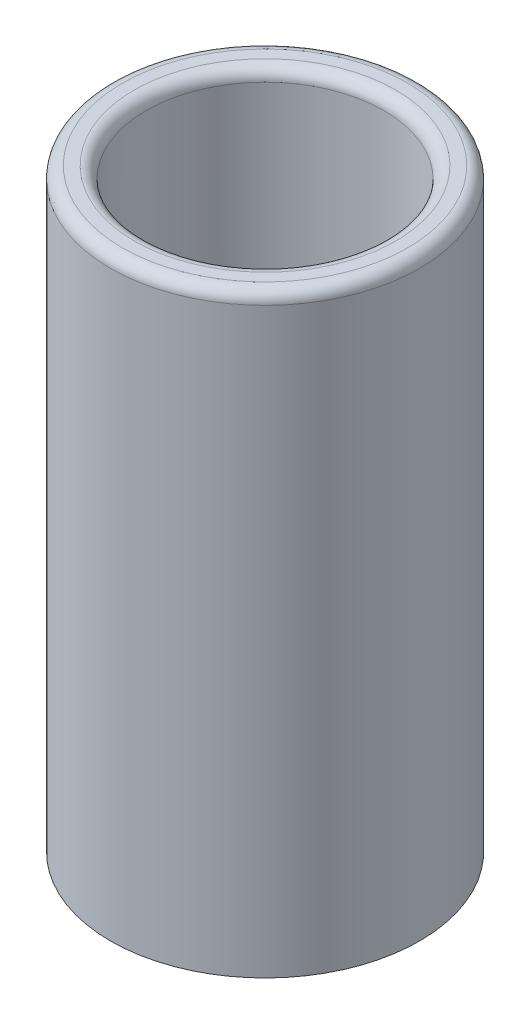
ISO-10303-21;
HEADER;
FILE_DESCRIPTION(('STEP AP214'),'2;1');
FILE_NAME('part.step','',(''),(''),'','','');
FILE_SCHEMA(('AUTOMOTIVE_DESIGN { 1 0 10303 214 1 1 1 1 }'));
ENDSEC;
DATA;
#1=APPLICATION_CONTEXT('core data for automotive mechanical design processes');
#2=APPLICATION_PROTOCOL_DEFINITION('international standard','automotive_design',2000,#1);
#3=PRODUCT_CONTEXT('',#1,'mechanical');
#4=PRODUCT('Part','Part','',(#3));
#5=PRODUCT_RELATED_PRODUCT_CATEGORY('part','',(#4));
#6=PRODUCT_DEFINITION_FORMATION('','',#4);
#7=PRODUCT_DEFINITION_CONTEXT('part definition',#1,'design');
#8=PRODUCT_DEFINITION('design','',#6,#7);
#9=PRODUCT_DEFINITION_SHAPE('','',#8);
#10=(LENGTH_UNIT() NAMED_UNIT(*) SI_UNIT(.MILLI.,.METRE.));
#11=(NAMED_UNIT(*) PLANE_ANGLE_UNIT() SI_UNIT($,.RADIAN.));
#12=(NAMED_UNIT(*) SI_UNIT($,.STERADIAN.) SOLID_ANGLE_UNIT());
#13=UNCERTAINTY_MEASURE_WITH_UNIT(LENGTH_MEASURE(1.E-05),#10,'distance_accuracy_value','');
#14=(GEOMETRIC_REPRESENTATION_CONTEXT(3) GLOBAL_UNCERTAINTY_ASSIGNED_CONTEXT((#13)) GLOBAL_UNIT_ASSIGNED_CONTEXT((#10,
#11,#12)) REPRESENTATION_CONTEXT('',''));
#15=CARTESIAN_POINT('',(0.,0.,0.));
#16=DIRECTION('',(0.,0.,1.));
#17=DIRECTION('',(1.,0.,0.));
#18=AXIS2_PLACEMENT_3D('',#15,#16,#17);
#19=CARTESIAN_POINT('',(0.,25.,0.));
#20=DIRECTION('',(0.,-1.,0.));
#21=DIRECTION('',(0.,0.,-1.));
#22=AXIS2_PLACEMENT_3D('',#19,#20,#21);
#23=CYLINDRICAL_SURFACE('',#22,6.5);
#24=CARTESIAN_POINT('',(0.,24.5,0.));
#25=DIRECTION('',(0.,1.,0.));
#26=DIRECTION('',(0.,0.,1.));
#27=AXIS2_PLACEMENT_3D('',#24,#25,#26);
#28=CIRCLE('',#27,6.5);
#29=CARTESIAN_POINT('',(0.,24.5,6.5));
#30=VERTEX_POINT('',#29);
#31=EDGE_CURVE('E11',#30,#30,#28,.F.);
#32=ORIENTED_EDGE('',*,*,#31,.T.);
#33=EDGE_LOOP('',(#32));
#34=FACE_BOUND('',#33,.T.);
#35=CARTESIAN_POINT('',(0.,0.,0.));
#36=DIRECTION('',(0.,1.,0.));
#37=DIRECTION('',(0.,0.,1.));
#38=AXIS2_PLACEMENT_3D('',#35,#36,#37);
#39=CIRCLE('',#38,6.5);
#40=CARTESIAN_POINT('',(0.,0.,6.5));
#41=VERTEX_POINT('',#40);
#42=EDGE_CURVE('E118',#41,#41,#39,.T.);
#43=ORIENTED_EDGE('',*,*,#42,.T.);
#44=EDGE_LOOP('',(#43));
#45=FACE_BOUND('',#44,.T.);
#46=ADVANCED_FACE('F45',(#34,#45),#23,.T.);
#47=CARTESIAN_POINT('',(0.,25.,0.));
#48=DIRECTION('',(0.,1.,0.));
#49=DIRECTION('',(0.,0.,1.));
#50=AXIS2_PLACEMENT_3D('',#47,#48,#49);
#51=PLANE('',#50);
#52=CARTESIAN_POINT('',(0.,25.,0.));
#53=DIRECTION('',(0.,1.,0.));
#54=DIRECTION('',(0.,0.,1.));
#55=AXIS2_PLACEMENT_3D('',#52,#53,#54);
#56=CIRCLE('',#55,6.);
#57=CARTESIAN_POINT('',(0.,25.,6.));
#58=VERTEX_POINT('',#57);
#59=EDGE_CURVE('E54',#58,#58,#56,.T.);
#60=ORIENTED_EDGE('',*,*,#59,.T.);
#61=EDGE_LOOP('',(#60));
#62=FACE_BOUND('',#61,.T.);
#63=CARTESIAN_POINT('',(0.,25.,0.));
#64=DIRECTION('',(0.,1.,0.));
#65=DIRECTION('',(0.,0.,1.));
#66=AXIS2_PLACEMENT_3D('',#63,#64,#65);
#67=CIRCLE('',#66,5.5);
#68=CARTESIAN_POINT('',(0.,25.,5.5));
#69=VERTEX_POINT('',#68);
#70=EDGE_CURVE('E128',#69,#69,#67,.F.);
#71=ORIENTED_EDGE('',*,*,#70,.T.);
#72=EDGE_LOOP('',(#71));
#73=FACE_BOUND('',#72,.T.);
#74=ADVANCED_FACE('F139',(#62,#73),#51,.T.);
#75=CARTESIAN_POINT('',(0.,0.,0.));
#76=DIRECTION('',(0.,1.,0.));
#77=DIRECTION('',(0.,0.,1.));
#78=AXIS2_PLACEMENT_3D('',#75,#76,#77);
#79=PLANE('',#78);
#80=DIRECTION('',(-1.,0.,0.));
#81=VECTOR('',#80,1.);
#82=CARTESIAN_POINT('',(-2.5,0.,1.5));
#83=LINE('',#82,#81);
#84=CARTESIAN_POINT('',(2.5,0.,1.5));
#85=VERTEX_POINT('',#84);
#86=CARTESIAN_POINT('',(-2.5,0.,1.5));
#87=VERTEX_POINT('',#86);
#88=EDGE_CURVE('E104',#85,#87,#83,.T.);
#89=ORIENTED_EDGE('',*,*,#88,.F.);
#90=DIRECTION('',(0.,0.,1.));
#91=VECTOR('',#90,1.);
#92=CARTESIAN_POINT('',(2.5,0.,1.5));
#93=LINE('',#92,#91);
#94=CARTESIAN_POINT('',(2.5,0.,-1.5));
#95=VERTEX_POINT('',#94);
#96=EDGE_CURVE('E61',#95,#85,#93,.T.);
#97=ORIENTED_EDGE('',*,*,#96,.F.);
#98=DIRECTION('',(1.,0.,0.));
#99=VECTOR('',#98,1.);
#100=CARTESIAN_POINT('',(-2.5,0.,-1.5));
#101=LINE('',#100,#99);
#102=CARTESIAN_POINT('',(-2.5,0.,-1.5));
#103=VERTEX_POINT('',#102);
#104=EDGE_CURVE('E89',#103,#95,#101,.T.);
#105=ORIENTED_EDGE('',*,*,#104,.F.);
#106=DIRECTION('',(0.,0.,-1.));
#107=VECTOR('',#106,1.);
#108=CARTESIAN_POINT('',(-2.5,0.,1.5));
#109=LINE('',#108,#107);
#110=EDGE_CURVE('E97',#87,#103,#109,.T.);
#111=ORIENTED_EDGE('',*,*,#110,.F.);
#112=EDGE_LOOP('',(#89,#97,#105,#111));
#113=FACE_BOUND('',#112,.T.);
#114=ORIENTED_EDGE('',*,*,#42,.F.);
#115=EDGE_LOOP('',(#114));
#116=FACE_BOUND('',#115,.T.);
#117=ADVANCED_FACE('F106',(#113,#116),#79,.F.);
#118=CARTESIAN_POINT('',(2.5,7.,1.5));
#119=DIRECTION('',(1.,0.,0.));
#120=DIRECTION('',(0.,0.,-1.));
#121=AXIS2_PLACEMENT_3D('',#118,#119,#120);
#122=PLANE('',#121);
#123=ORIENTED_EDGE('',*,*,#96,.T.);
#124=DIRECTION('',(0.,-1.,0.));
#125=VECTOR('',#124,1.);
#126=CARTESIAN_POINT('',(2.5,7.,1.5));
#127=LINE('',#126,#125);
#128=CARTESIAN_POINT('',(2.5,7.,1.5));
#129=VERTEX_POINT('',#128);
#130=EDGE_CURVE('E122',#129,#85,#127,.T.);
#131=ORIENTED_EDGE('',*,*,#130,.F.);
#132=DIRECTION('',(0.,0.,1.));
#133=VECTOR('',#132,1.);
#134=CARTESIAN_POINT('',(2.5,7.,1.5));
#135=LINE('',#134,#133);
#136=CARTESIAN_POINT('',(2.5,7.,-1.5));
#137=VERTEX_POINT('',#136);
#138=EDGE_CURVE('E109',#137,#129,#135,.T.);
#139=ORIENTED_EDGE('',*,*,#138,.F.);
#140=DIRECTION('',(0.,-1.,0.));
#141=VECTOR('',#140,1.);
#142=CARTESIAN_POINT('',(2.5,7.,-1.5));
#143=LINE('',#142,#141);
#144=EDGE_CURVE('E93',#137,#95,#143,.T.);
#145=ORIENTED_EDGE('',*,*,#144,.T.);
#146=EDGE_LOOP('',(#123,#131,#139,#145));
#147=FACE_BOUND('',#146,.T.);
#148=ADVANCED_FACE('F161',(#147),#122,.F.);
#149=CARTESIAN_POINT('',(-2.5,7.,-1.5));
#150=DIRECTION('',(0.,0.,-1.));
#151=DIRECTION('',(-1.,0.,0.));
#152=AXIS2_PLACEMENT_3D('',#149,#150,#151);
#153=PLANE('',#152);
#154=ORIENTED_EDGE('',*,*,#104,.T.);
#155=ORIENTED_EDGE('',*,*,#144,.F.);
#156=DIRECTION('',(1.,0.,0.));
#157=VECTOR('',#156,1.);
#158=CARTESIAN_POINT('',(-2.5,7.,-1.5));
#159=LINE('',#158,#157);
#160=CARTESIAN_POINT('',(-2.5,7.,-1.5));
#161=VERTEX_POINT('',#160);
#162=EDGE_CURVE('E90',#161,#137,#159,.T.);
#163=ORIENTED_EDGE('',*,*,#162,.F.);
#164=DIRECTION('',(0.,-1.,0.));
#165=VECTOR('',#164,1.);
#166=CARTESIAN_POINT('',(-2.5,7.,-1.5));
#167=LINE('',#166,#165);
#168=EDGE_CURVE('E84',#161,#103,#167,.T.);
#169=ORIENTED_EDGE('',*,*,#168,.T.);
#170=EDGE_LOOP('',(#154,#155,#163,#169));
#171=FACE_BOUND('',#170,.T.);
#172=ADVANCED_FACE('F86',(#171),#153,.F.);
#173=CARTESIAN_POINT('',(-2.5,7.,1.5));
#174=DIRECTION('',(-1.,0.,0.));
#175=DIRECTION('',(0.,0.,1.));
#176=AXIS2_PLACEMENT_3D('',#173,#174,#175);
#177=PLANE('',#176);
#178=ORIENTED_EDGE('',*,*,#110,.T.);
#179=ORIENTED_EDGE('',*,*,#168,.F.);
#180=DIRECTION('',(0.,0.,-1.));
#181=VECTOR('',#180,1.);
#182=CARTESIAN_POINT('',(-2.5,7.,1.5));
#183=LINE('',#182,#181);
#184=CARTESIAN_POINT('',(-2.5,7.,1.5));
#185=VERTEX_POINT('',#184);
#186=EDGE_CURVE('E70',#185,#161,#183,.T.);
#187=ORIENTED_EDGE('',*,*,#186,.F.);
#188=DIRECTION('',(0.,-1.,0.));
#189=VECTOR('',#188,1.);
#190=CARTESIAN_POINT('',(-2.5,7.,1.5));
#191=LINE('',#190,#189);
#192=EDGE_CURVE('E94',#185,#87,#191,.T.);
#193=ORIENTED_EDGE('',*,*,#192,.T.);
#194=EDGE_LOOP('',(#178,#179,#187,#193));
#195=FACE_BOUND('',#194,.T.);
#196=ADVANCED_FACE('F98',(#195),#177,.F.);
#197=CARTESIAN_POINT('',(-2.5,7.,1.5));
#198=DIRECTION('',(0.,0.,1.));
#199=DIRECTION('',(1.,0.,0.));
#200=AXIS2_PLACEMENT_3D('',#197,#198,#199);
#201=PLANE('',#200);
#202=ORIENTED_EDGE('',*,*,#88,.T.);
#203=ORIENTED_EDGE('',*,*,#192,.F.);
#204=DIRECTION('',(-1.,0.,0.));
#205=VECTOR('',#204,1.);
#206=CARTESIAN_POINT('',(-2.5,7.,1.5));
#207=LINE('',#206,#205);
#208=EDGE_CURVE('E113',#129,#185,#207,.T.);
#209=ORIENTED_EDGE('',*,*,#208,.F.);
#210=ORIENTED_EDGE('',*,*,#130,.T.);
#211=EDGE_LOOP('',(#202,#203,#209,#210));
#212=FACE_BOUND('',#211,.T.);
#213=ADVANCED_FACE('F165',(#212),#201,.F.);
#214=CARTESIAN_POINT('',(0.,7.,0.));
#215=DIRECTION('',(0.,1.,0.));
#216=DIRECTION('',(0.,0.,1.));
#217=AXIS2_PLACEMENT_3D('',#214,#215,#216);
#218=PLANE('',#217);
#219=CARTESIAN_POINT('',(0.,7.,0.));
#220=DIRECTION('',(0.,1.,0.));
#221=DIRECTION('',(0.,0.,1.));
#222=AXIS2_PLACEMENT_3D('',#219,#220,#221);
#223=CIRCLE('',#222,5.);
#224=CARTESIAN_POINT('',(0.,7.,-5.));
#225=VERTEX_POINT('',#224);
#226=EDGE_CURVE('E183',#225,#225,#223,.T.);
#227=ORIENTED_EDGE('',*,*,#226,.T.);
#228=EDGE_LOOP('',(#227));
#229=FACE_BOUND('',#228,.T.);
#230=ORIENTED_EDGE('',*,*,#138,.T.);
#231=ORIENTED_EDGE('',*,*,#208,.T.);
#232=ORIENTED_EDGE('',*,*,#186,.T.);
#233=ORIENTED_EDGE('',*,*,#162,.T.);
#234=EDGE_LOOP('',(#230,#231,#232,#233));
#235=FACE_BOUND('',#234,.T.);
#236=ADVANCED_FACE('F168',(#229,#235),#218,.T.);
#237=CARTESIAN_POINT('',(0.,25.000012,0.));
#238=DIRECTION('',(0.,-1.,0.));
#239=DIRECTION('',(0.,0.,-1.));
#240=AXIS2_PLACEMENT_3D('',#237,#238,#239);
#241=CYLINDRICAL_SURFACE('',#240,5.);
#242=CARTESIAN_POINT('',(0.,24.5,0.));
#243=DIRECTION('',(0.,1.,0.));
#244=DIRECTION('',(0.,0.,1.));
#245=AXIS2_PLACEMENT_3D('',#242,#243,#244);
#246=CIRCLE('',#245,5.);
#247=CARTESIAN_POINT('',(0.,24.5,-5.));
#248=VERTEX_POINT('',#247);
#249=EDGE_CURVE('E132',#248,#248,#246,.T.);
#250=CARTESIAN_POINT('',(0.,24.5,-5.));
#251=CARTESIAN_POINT('',(0.,24.3177083333333,-5.));
#252=CARTESIAN_POINT('',(0.,24.1354166666667,-5.));
#253=CARTESIAN_POINT('',(0.,23.7708333333333,-5.));
#254=CARTESIAN_POINT('',(0.,23.5885416666667,-5.));
#255=CARTESIAN_POINT('',(0.,23.2239583333333,-5.));
#256=CARTESIAN_POINT('',(0.,23.0416666666667,-5.));
#257=CARTESIAN_POINT('',(0.,22.6770833333333,-5.));
#258=CARTESIAN_POINT('',(0.,22.4947916666667,-5.));
#259=CARTESIAN_POINT('',(0.,22.1302083333333,-5.));
#260=CARTESIAN_POINT('',(0.,21.9479166666667,-5.));
#261=CARTESIAN_POINT('',(0.,21.5833333333333,-5.));
#262=CARTESIAN_POINT('',(0.,21.4010416666667,-5.));
#263=CARTESIAN_POINT('',(0.,21.0364583333333,-5.));
#264=CARTESIAN_POINT('',(0.,20.8541666666667,-5.));
#265=CARTESIAN_POINT('',(0.,20.4895833333333,-5.));
#266=CARTESIAN_POINT('',(0.,20.3072916666667,-5.));
#267=CARTESIAN_POINT('',(0.,19.9427083333333,-5.));
#268=CARTESIAN_POINT('',(0.,19.7604166666667,-5.));
#269=CARTESIAN_POINT('',(0.,19.3958333333333,-5.));
#270=CARTESIAN_POINT('',(0.,19.2135416666667,-5.));
#271=CARTESIAN_POINT('',(0.,18.8489583333333,-5.));
#272=CARTESIAN_POINT('',(0.,18.6666666666667,-5.));
#273=CARTESIAN_POINT('',(0.,18.3020833333333,-5.));
#274=CARTESIAN_POINT('',(0.,18.1197916666667,-5.));
#275=CARTESIAN_POINT('',(0.,17.7552083333333,-5.));
#276=CARTESIAN_POINT('',(0.,17.5729166666667,-5.));
#277=CARTESIAN_POINT('',(0.,17.2083333333333,-5.));
#278=CARTESIAN_POINT('',(0.,17.0260416666667,-5.));
#279=CARTESIAN_POINT('',(0.,16.6614583333333,-5.));
#280=CARTESIAN_POINT('',(0.,16.4791666666667,-5.));
#281=CARTESIAN_POINT('',(0.,16.1145833333333,-5.));
#282=CARTESIAN_POINT('',(0.,15.9322916666667,-5.));
#283=CARTESIAN_POINT('',(0.,15.5677083333333,-5.));
#284=CARTESIAN_POINT('',(0.,15.3854166666667,-5.));
#285=CARTESIAN_POINT('',(0.,15.0208333333333,-5.));
#286=CARTESIAN_POINT('',(0.,14.8385416666667,-5.));
#287=CARTESIAN_POINT('',(0.,14.4739583333333,-5.));
#288=CARTESIAN_POINT('',(0.,14.2916666666667,-5.));
#289=CARTESIAN_POINT('',(0.,13.9270833333333,-5.));
#290=CARTESIAN_POINT('',(0.,13.7447916666667,-5.));
#291=CARTESIAN_POINT('',(0.,13.3802083333333,-5.));
#292=CARTESIAN_POINT('',(0.,13.1979166666667,-5.));
#293=CARTESIAN_POINT('',(0.,12.8333333333333,-5.));
#294=CARTESIAN_POINT('',(0.,12.6510416666667,-5.));
#295=CARTESIAN_POINT('',(0.,12.2864583333333,-5.));
#296=CARTESIAN_POINT('',(0.,12.1041666666667,-5.));
#297=CARTESIAN_POINT('',(0.,11.7395833333333,-5.));
#298=CARTESIAN_POINT('',(0.,11.5572916666667,-5.));
#299=CARTESIAN_POINT('',(0.,11.1927083333333,-5.));
#300=CARTESIAN_POINT('',(0.,11.0104166666667,-5.));
#301=CARTESIAN_POINT('',(0.,10.6458333333333,-5.));
#302=CARTESIAN_POINT('',(0.,10.4635416666667,-5.));
#303=CARTESIAN_POINT('',(0.,10.0989583333333,-5.));
#304=CARTESIAN_POINT('',(0.,9.91666666666667,-5.));
#305=CARTESIAN_POINT('',(0.,9.55208333333334,-5.));
#306=CARTESIAN_POINT('',(0.,9.36979166666667,-5.));
#307=CARTESIAN_POINT('',(0.,9.00520833333334,-5.));
#308=CARTESIAN_POINT('',(0.,8.82291666666667,-5.));
#309=CARTESIAN_POINT('',(0.,8.45833333333334,-5.));
#310=CARTESIAN_POINT('',(0.,8.27604166666667,-5.));
#311=CARTESIAN_POINT('',(0.,7.91145833333334,-5.));
#312=CARTESIAN_POINT('',(0.,7.72916666666667,-5.));
#313=CARTESIAN_POINT('',(0.,7.36458333333333,-5.));
#314=CARTESIAN_POINT('',(0.,7.18229166666667,-5.));
#315=CARTESIAN_POINT('',(0.,7.,-5.));
#316=B_SPLINE_CURVE_WITH_KNOTS('',3,(#250,#251,#252,#253,#254,#255,#256,#257,#258,#259,#260,
#261,#262,#263,#264,#265,#266,#267,#268,#269,#270,#271,#272,#273,#274,#275,#276,#277,#278,#279,
#280,#281,#282,#283,#284,#285,#286,#287,#288,#289,#290,#291,#292,#293,#294,#295,#296,#297,#298,
#299,#300,#301,#302,#303,#304,#305,#306,#307,#308,#309,#310,#311,#312,#313,#314,#315),
.UNSPECIFIED.,.F.,.F.,(4,2,2,2,2,2,2,2,2,2,2,2,2,2,2,2,2,2,2,2,2,2,2,2,2,2,2,2,2,2,2,2,4),(0.,
0.546874999999999,1.09375,1.640625,2.1875,2.734375,3.28125,3.828125,4.375,4.921875,5.46875,
6.015625,6.5625,7.109375,7.65625,8.20312499999999,8.75,9.296875,9.84374999999999,10.390625,
10.9375,11.484375,12.03125,12.578125,13.125,13.671875,14.21875,14.765625,15.3125,15.859375,
16.40625,16.953125,17.5),.UNSPECIFIED.);
#317=EDGE_CURVE('BSEAM149',#248,#225,#316,.T.);
#318=ORIENTED_EDGE('',*,*,#249,.T.);
#319=ORIENTED_EDGE('',*,*,#226,.F.);
#320=ORIENTED_EDGE('',*,*,#317,.T.);
#321=ORIENTED_EDGE('',*,*,#317,.F.);
#322=EDGE_LOOP('',(#318,#320,#319,#321));
#323=FACE_BOUND('',#322,.T.);
#324=ADVANCED_FACE('F149',(#323),#241,.F.);
#325=CARTESIAN_POINT('',(0.,24.5,0.));
#326=DIRECTION('',(0.,1.,0.));
#327=DIRECTION('',(0.,0.,1.));
#328=AXIS2_PLACEMENT_3D('',#325,#326,#327);
#329=TOROIDAL_SURFACE('',#328,5.5,0.5);
#330=ORIENTED_EDGE('',*,*,#249,.F.);
#331=EDGE_LOOP('',(#330));
#332=FACE_BOUND('',#331,.T.);
#333=ORIENTED_EDGE('',*,*,#70,.F.);
#334=EDGE_LOOP('',(#333));
#335=FACE_BOUND('',#334,.T.);
#336=ADVANCED_FACE('F143',(#332,#335),#329,.T.);
#337=CARTESIAN_POINT('',(0.,24.5,0.));
#338=DIRECTION('',(0.,1.,0.));
#339=DIRECTION('',(0.,0.,1.));
#340=AXIS2_PLACEMENT_3D('',#337,#338,#339);
#341=TOROIDAL_SURFACE('',#340,6.,0.5);
#342=ORIENTED_EDGE('',*,*,#31,.F.);
#343=EDGE_LOOP('',(#342));
#344=FACE_BOUND('',#343,.T.);
#345=ORIENTED_EDGE('',*,*,#59,.F.);
#346=EDGE_LOOP('',(#345));
#347=FACE_BOUND('',#346,.T.);
#348=ADVANCED_FACE('F47',(#344,#347),#341,.T.);
#349=CLOSED_SHELL('',(#46,#74,#117,#148,#172,#196,#213,#236,#324,#336,#348));
#350=MANIFOLD_SOLID_BREP('B2',#349);
#351=ADVANCED_BREP_SHAPE_REPRESENTATION('',(#18,#350),#14);
#352=SHAPE_DEFINITION_REPRESENTATION(#9,#351);
ENDSEC;
END-ISO-10303-21;
